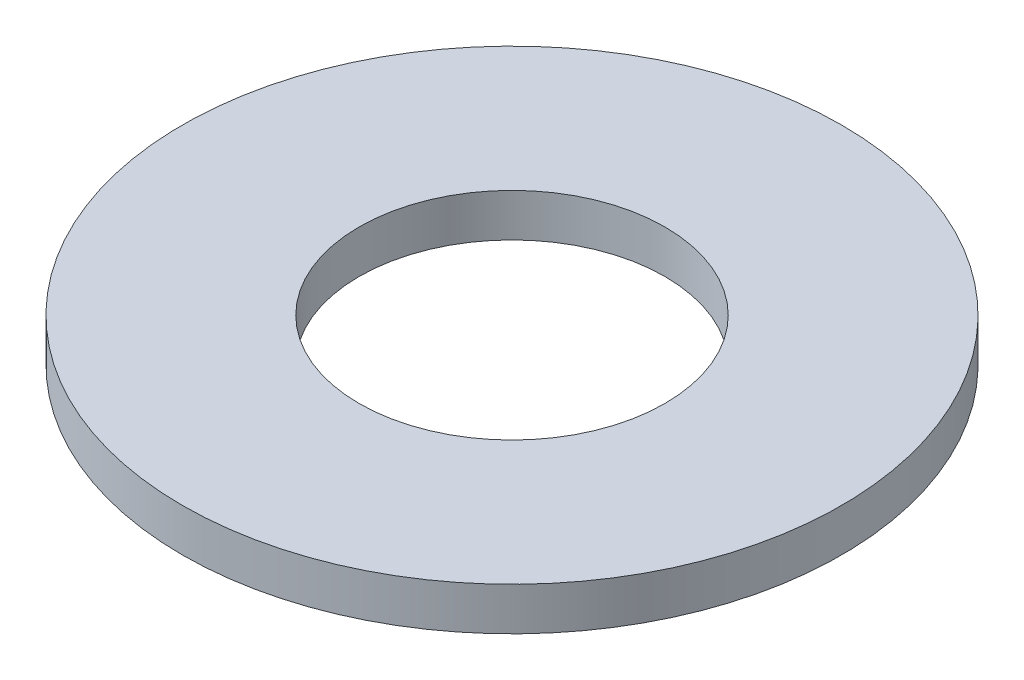
ISO-10303-21;
HEADER;
FILE_DESCRIPTION(('STEP AP214'),'2;1');
FILE_NAME('part.step','',(''),(''),'','','');
FILE_SCHEMA(('AUTOMOTIVE_DESIGN { 1 0 10303 214 1 1 1 1 }'));
ENDSEC;
DATA;
#1=APPLICATION_CONTEXT('core data for automotive mechanical design processes');
#2=APPLICATION_PROTOCOL_DEFINITION('international standard','automotive_design',2000,#1);
#3=PRODUCT_CONTEXT('',#1,'mechanical');
#4=PRODUCT('Part','Part','',(#3));
#5=PRODUCT_RELATED_PRODUCT_CATEGORY('part','',(#4));
#6=PRODUCT_DEFINITION_FORMATION('','',#4);
#7=PRODUCT_DEFINITION_CONTEXT('part definition',#1,'design');
#8=PRODUCT_DEFINITION('design','',#6,#7);
#9=PRODUCT_DEFINITION_SHAPE('','',#8);
#10=(LENGTH_UNIT() NAMED_UNIT(*) SI_UNIT(.MILLI.,.METRE.));
#11=(NAMED_UNIT(*) PLANE_ANGLE_UNIT() SI_UNIT($,.RADIAN.));
#12=(NAMED_UNIT(*) SI_UNIT($,.STERADIAN.) SOLID_ANGLE_UNIT());
#13=UNCERTAINTY_MEASURE_WITH_UNIT(LENGTH_MEASURE(1.E-05),#10,'distance_accuracy_value','');
#14=(GEOMETRIC_REPRESENTATION_CONTEXT(3) GLOBAL_UNCERTAINTY_ASSIGNED_CONTEXT((#13)) GLOBAL_UNIT_ASSIGNED_CONTEXT((#10,
#11,#12)) REPRESENTATION_CONTEXT('',''));
#15=CARTESIAN_POINT('',(0.,0.,0.));
#16=DIRECTION('',(0.,0.,1.));
#17=DIRECTION('',(1.,0.,0.));
#18=AXIS2_PLACEMENT_3D('',#15,#16,#17);
#19=CARTESIAN_POINT('',(0.,0.,0.));
#20=DIRECTION('',(0.,1.,0.));
#21=DIRECTION('',(0.,0.,1.));
#22=AXIS2_PLACEMENT_3D('',#19,#20,#21);
#23=PLANE('',#22);
#24=CARTESIAN_POINT('',(0.,0.,0.));
#25=DIRECTION('',(0.,-1.,0.));
#26=DIRECTION('',(0.,0.,-1.));
#27=AXIS2_PLACEMENT_3D('',#24,#25,#26);
#28=CIRCLE('',#27,11.1125);
#29=CARTESIAN_POINT('',(0.,0.,-11.1125));
#30=VERTEX_POINT('',#29);
#31=EDGE_CURVE('E26',#30,#30,#28,.F.);
#32=ORIENTED_EDGE('',*,*,#31,.F.);
#33=EDGE_LOOP('',(#32));
#34=FACE_BOUND('',#33,.T.);
#35=CARTESIAN_POINT('',(0.,0.,0.));
#36=DIRECTION('',(0.,1.,0.));
#37=DIRECTION('',(0.,0.,1.));
#38=AXIS2_PLACEMENT_3D('',#35,#36,#37);
#39=CIRCLE('',#38,5.1562);
#40=CARTESIAN_POINT('',(0.,0.,5.1562));
#41=VERTEX_POINT('',#40);
#42=EDGE_CURVE('E17',#41,#41,#39,.T.);
#43=ORIENTED_EDGE('',*,*,#42,.T.);
#44=EDGE_LOOP('',(#43));
#45=FACE_BOUND('',#44,.T.);
#46=ADVANCED_FACE('F14',(#34,#45),#23,.F.);
#47=CARTESIAN_POINT('',(0.,0.,0.));
#48=DIRECTION('',(0.,1.,0.));
#49=DIRECTION('',(0.,0.,1.));
#50=AXIS2_PLACEMENT_3D('',#47,#48,#49);
#51=CYLINDRICAL_SURFACE('',#50,5.1562);
#52=CARTESIAN_POINT('',(0.,1.4478,0.));
#53=DIRECTION('',(0.,1.,0.));
#54=DIRECTION('',(0.,0.,1.));
#55=AXIS2_PLACEMENT_3D('',#52,#53,#54);
#56=CIRCLE('',#55,5.1562);
#57=CARTESIAN_POINT('',(0.,1.4478,5.1562));
#58=VERTEX_POINT('',#57);
#59=EDGE_CURVE('E21',#58,#58,#56,.F.);
#60=ORIENTED_EDGE('',*,*,#59,.F.);
#61=EDGE_LOOP('',(#60));
#62=FACE_BOUND('',#61,.T.);
#63=ORIENTED_EDGE('',*,*,#42,.F.);
#64=EDGE_LOOP('',(#63));
#65=FACE_BOUND('',#64,.T.);
#66=ADVANCED_FACE('F35',(#62,#65),#51,.F.);
#67=CARTESIAN_POINT('',(0.,1.4478,0.));
#68=DIRECTION('',(0.,-1.,0.));
#69=DIRECTION('',(0.,0.,-1.));
#70=AXIS2_PLACEMENT_3D('',#67,#68,#69);
#71=CYLINDRICAL_SURFACE('',#70,11.1125);
#72=ORIENTED_EDGE('',*,*,#31,.T.);
#73=EDGE_LOOP('',(#72));
#74=FACE_BOUND('',#73,.T.);
#75=CARTESIAN_POINT('',(0.,1.4478,0.));
#76=DIRECTION('',(0.,-1.,0.));
#77=DIRECTION('',(0.,0.,-1.));
#78=AXIS2_PLACEMENT_3D('',#75,#76,#77);
#79=CIRCLE('',#78,11.1125);
#80=CARTESIAN_POINT('',(0.,1.4478,-11.1125));
#81=VERTEX_POINT('',#80);
#82=EDGE_CURVE('E10',#81,#81,#79,.F.);
#83=ORIENTED_EDGE('',*,*,#82,.F.);
#84=EDGE_LOOP('',(#83));
#85=FACE_BOUND('',#84,.T.);
#86=ADVANCED_FACE('F37',(#74,#85),#71,.T.);
#87=CARTESIAN_POINT('',(0.,1.4478,0.));
#88=DIRECTION('',(0.,1.,0.));
#89=DIRECTION('',(0.,0.,1.));
#90=AXIS2_PLACEMENT_3D('',#87,#88,#89);
#91=PLANE('',#90);
#92=ORIENTED_EDGE('',*,*,#82,.T.);
#93=EDGE_LOOP('',(#92));
#94=FACE_BOUND('',#93,.T.);
#95=ORIENTED_EDGE('',*,*,#59,.T.);
#96=EDGE_LOOP('',(#95));
#97=FACE_BOUND('',#96,.T.);
#98=ADVANCED_FACE('F44',(#94,#97),#91,.T.);
#99=CLOSED_SHELL('',(#46,#66,#86,#98));
#100=MANIFOLD_SOLID_BREP('B1',#99);
#101=ADVANCED_BREP_SHAPE_REPRESENTATION('',(#18,#100),#14);
#102=SHAPE_DEFINITION_REPRESENTATION(#9,#101);
ENDSEC;
END-ISO-10303-21;
